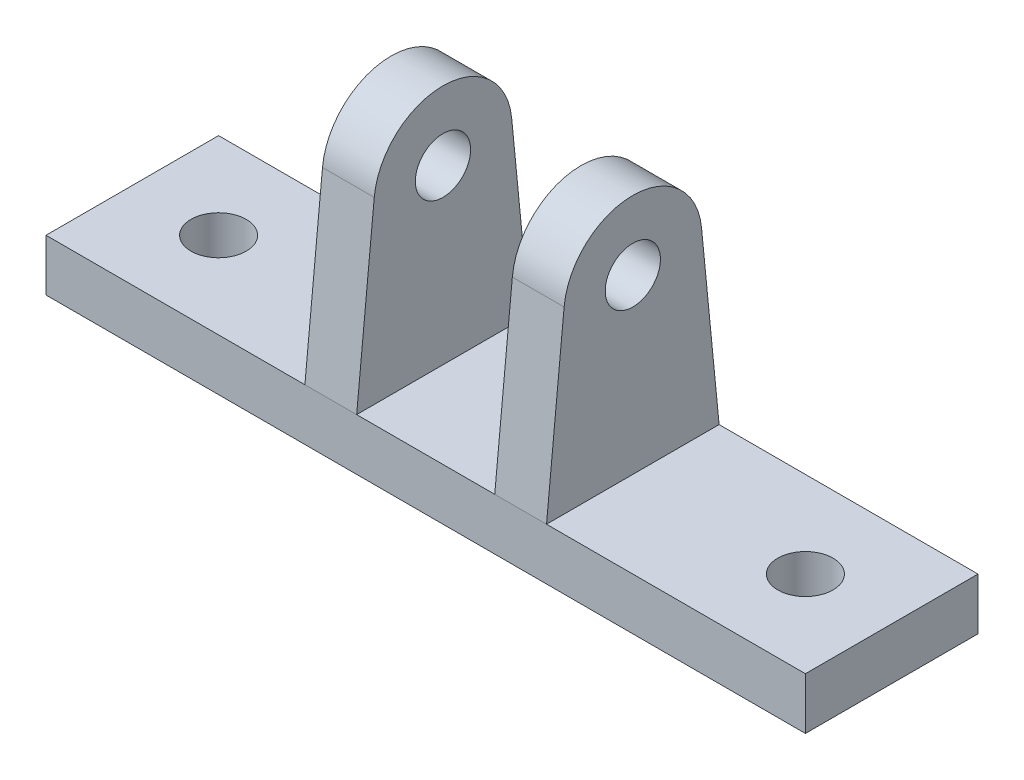
ISO-10303-21;
HEADER;
FILE_DESCRIPTION(('STEP AP214'),'2;1');
FILE_NAME('part.step','',(''),(''),'','','');
FILE_SCHEMA(('AUTOMOTIVE_DESIGN { 1 0 10303 214 1 1 1 1 }'));
ENDSEC;
DATA;
#1=APPLICATION_CONTEXT('core data for automotive mechanical design processes');
#2=APPLICATION_PROTOCOL_DEFINITION('international standard','automotive_design',2000,#1);
#3=PRODUCT_CONTEXT('',#1,'mechanical');
#4=PRODUCT('Part','Part','',(#3));
#5=PRODUCT_RELATED_PRODUCT_CATEGORY('part','',(#4));
#6=PRODUCT_DEFINITION_FORMATION('','',#4);
#7=PRODUCT_DEFINITION_CONTEXT('part definition',#1,'design');
#8=PRODUCT_DEFINITION('design','',#6,#7);
#9=PRODUCT_DEFINITION_SHAPE('','',#8);
#10=(LENGTH_UNIT() NAMED_UNIT(*) SI_UNIT(.MILLI.,.METRE.));
#11=(NAMED_UNIT(*) PLANE_ANGLE_UNIT() SI_UNIT($,.RADIAN.));
#12=(NAMED_UNIT(*) SI_UNIT($,.STERADIAN.) SOLID_ANGLE_UNIT());
#13=UNCERTAINTY_MEASURE_WITH_UNIT(LENGTH_MEASURE(1.E-05),#10,'distance_accuracy_value','');
#14=(GEOMETRIC_REPRESENTATION_CONTEXT(3) GLOBAL_UNCERTAINTY_ASSIGNED_CONTEXT((#13)) GLOBAL_UNIT_ASSIGNED_CONTEXT((#10,
#11,#12)) REPRESENTATION_CONTEXT('',''));
#15=CARTESIAN_POINT('',(0.,0.,0.));
#16=DIRECTION('',(0.,0.,1.));
#17=DIRECTION('',(1.,0.,0.));
#18=AXIS2_PLACEMENT_3D('',#15,#16,#17);
#19=CARTESIAN_POINT('',(0.,3.,0.));
#20=DIRECTION('',(0.,1.,0.));
#21=DIRECTION('',(0.,0.,1.));
#22=AXIS2_PLACEMENT_3D('',#19,#20,#21);
#23=PLANE('',#22);
#24=DIRECTION('',(1.,0.,0.));
#25=VECTOR('',#24,1.);
#26=CARTESIAN_POINT('',(0.,3.,-5.));
#27=LINE('',#26,#25);
#28=CARTESIAN_POINT('',(-4.,3.,-5.));
#29=VERTEX_POINT('',#28);
#30=CARTESIAN_POINT('',(4.,3.,-5.));
#31=VERTEX_POINT('',#30);
#32=EDGE_CURVE('E178',#29,#31,#27,.T.);
#33=ORIENTED_EDGE('',*,*,#32,.F.);
#34=DIRECTION('',(0.,0.,1.));
#35=VECTOR('',#34,1.);
#36=CARTESIAN_POINT('',(-4.,3.,0.));
#37=LINE('',#36,#35);
#38=CARTESIAN_POINT('',(-4.,3.,5.));
#39=VERTEX_POINT('',#38);
#40=EDGE_CURVE('E284',#29,#39,#37,.T.);
#41=ORIENTED_EDGE('',*,*,#40,.T.);
#42=DIRECTION('',(-1.,0.,0.));
#43=VECTOR('',#42,1.);
#44=CARTESIAN_POINT('',(0.,3.,5.));
#45=LINE('',#44,#43);
#46=CARTESIAN_POINT('',(4.,3.,5.));
#47=VERTEX_POINT('',#46);
#48=EDGE_CURVE('E204',#47,#39,#45,.T.);
#49=ORIENTED_EDGE('',*,*,#48,.F.);
#50=DIRECTION('',(0.,0.,1.));
#51=VECTOR('',#50,1.);
#52=CARTESIAN_POINT('',(4.,3.,0.));
#53=LINE('',#52,#51);
#54=EDGE_CURVE('E239',#31,#47,#53,.T.);
#55=ORIENTED_EDGE('',*,*,#54,.F.);
#56=EDGE_LOOP('',(#33,#41,#49,#55));
#57=FACE_BOUND('',#56,.T.);
#58=ADVANCED_FACE('F44',(#57),#23,.T.);
#59=CARTESIAN_POINT('',(17.,3.,0.));
#60=DIRECTION('',(0.,1.,0.));
#61=DIRECTION('',(0.,0.,1.));
#62=AXIS2_PLACEMENT_3D('',#59,#60,#61);
#63=CIRCLE('',#62,1.6);
#64=CARTESIAN_POINT('',(17.,3.,1.6));
#65=VERTEX_POINT('',#64);
#66=EDGE_CURVE('E213',#65,#65,#63,.T.);
#67=ORIENTED_EDGE('',*,*,#66,.F.);
#68=EDGE_LOOP('',(#67));
#69=FACE_BOUND('',#68,.T.);
#70=CARTESIAN_POINT('',(7.,3.,-5.));
#71=VERTEX_POINT('',#70);
#72=CARTESIAN_POINT('',(22.,3.,-5.));
#73=VERTEX_POINT('',#72);
#74=EDGE_CURVE('E180',#71,#73,#27,.T.);
#75=ORIENTED_EDGE('',*,*,#74,.F.);
#76=DIRECTION('',(0.,0.,1.));
#77=VECTOR('',#76,1.);
#78=CARTESIAN_POINT('',(7.,3.,0.));
#79=LINE('',#78,#77);
#80=CARTESIAN_POINT('',(7.,3.,5.));
#81=VERTEX_POINT('',#80);
#82=EDGE_CURVE('E255',#71,#81,#79,.T.);
#83=ORIENTED_EDGE('',*,*,#82,.T.);
#84=CARTESIAN_POINT('',(22.,3.,5.));
#85=VERTEX_POINT('',#84);
#86=EDGE_CURVE('E198',#85,#81,#45,.T.);
#87=ORIENTED_EDGE('',*,*,#86,.F.);
#88=DIRECTION('',(0.,0.,1.));
#89=VECTOR('',#88,1.);
#90=CARTESIAN_POINT('',(22.,3.,0.));
#91=LINE('',#90,#89);
#92=EDGE_CURVE('E190',#73,#85,#91,.T.);
#93=ORIENTED_EDGE('',*,*,#92,.F.);
#94=EDGE_LOOP('',(#75,#83,#87,#93));
#95=FACE_BOUND('',#94,.T.);
#96=ADVANCED_FACE('F344',(#69,#95),#23,.T.);
#97=CARTESIAN_POINT('',(-22.,3.,0.));
#98=DIRECTION('',(-1.,0.,0.));
#99=DIRECTION('',(0.,0.,1.));
#100=AXIS2_PLACEMENT_3D('',#97,#98,#99);
#101=PLANE('',#100);
#102=DIRECTION('',(0.,0.,-1.));
#103=VECTOR('',#102,1.);
#104=CARTESIAN_POINT('',(-22.,0.,0.));
#105=LINE('',#104,#103);
#106=CARTESIAN_POINT('',(-22.,0.,5.));
#107=VERTEX_POINT('',#106);
#108=CARTESIAN_POINT('',(-22.,0.,-5.));
#109=VERTEX_POINT('',#108);
#110=EDGE_CURVE('E319',#107,#109,#105,.T.);
#111=ORIENTED_EDGE('',*,*,#110,.F.);
#112=DIRECTION('',(0.,-1.,0.));
#113=VECTOR('',#112,1.);
#114=CARTESIAN_POINT('',(-22.,3.,5.));
#115=LINE('',#114,#113);
#116=CARTESIAN_POINT('',(-22.,3.,5.));
#117=VERTEX_POINT('',#116);
#118=EDGE_CURVE('E11',#117,#107,#115,.T.);
#119=ORIENTED_EDGE('',*,*,#118,.F.);
#120=DIRECTION('',(0.,0.,-1.));
#121=VECTOR('',#120,1.);
#122=CARTESIAN_POINT('',(-22.,3.,0.));
#123=LINE('',#122,#121);
#124=CARTESIAN_POINT('',(-22.,3.,-5.));
#125=VERTEX_POINT('',#124);
#126=EDGE_CURVE('E207',#117,#125,#123,.T.);
#127=ORIENTED_EDGE('',*,*,#126,.T.);
#128=DIRECTION('',(0.,-1.,0.));
#129=VECTOR('',#128,1.);
#130=CARTESIAN_POINT('',(-22.,3.,-5.));
#131=LINE('',#130,#129);
#132=EDGE_CURVE('E175',#125,#109,#131,.T.);
#133=ORIENTED_EDGE('',*,*,#132,.T.);
#134=EDGE_LOOP('',(#111,#119,#127,#133));
#135=FACE_BOUND('',#134,.T.);
#136=ADVANCED_FACE('F317',(#135),#101,.T.);
#137=CARTESIAN_POINT('',(0.,3.,5.));
#138=DIRECTION('',(0.,0.,1.));
#139=DIRECTION('',(1.,0.,0.));
#140=AXIS2_PLACEMENT_3D('',#137,#138,#139);
#141=PLANE('',#140);
#142=DIRECTION('',(-1.,0.,0.));
#143=VECTOR('',#142,1.);
#144=CARTESIAN_POINT('',(0.,0.,5.));
#145=LINE('',#144,#143);
#146=CARTESIAN_POINT('',(22.,0.,5.));
#147=VERTEX_POINT('',#146);
#148=EDGE_CURVE('E324',#147,#107,#145,.T.);
#149=ORIENTED_EDGE('',*,*,#148,.F.);
#150=DIRECTION('',(0.,-1.,0.));
#151=VECTOR('',#150,1.);
#152=CARTESIAN_POINT('',(22.,3.,5.));
#153=LINE('',#152,#151);
#154=EDGE_CURVE('E53',#85,#147,#153,.T.);
#155=ORIENTED_EDGE('',*,*,#154,.F.);
#156=ORIENTED_EDGE('',*,*,#86,.T.);
#157=DIRECTION('',(-1.,0.,0.));
#158=VECTOR('',#157,1.);
#159=CARTESIAN_POINT('',(7.,3.,5.));
#160=LINE('',#159,#158);
#161=EDGE_CURVE('E226',#81,#47,#160,.T.);
#162=ORIENTED_EDGE('',*,*,#161,.T.);
#163=ORIENTED_EDGE('',*,*,#48,.T.);
#164=DIRECTION('',(1.,0.,0.));
#165=VECTOR('',#164,1.);
#166=CARTESIAN_POINT('',(-7.,3.,5.));
#167=LINE('',#166,#165);
#168=CARTESIAN_POINT('',(-7.,3.,5.));
#169=VERTEX_POINT('',#168);
#170=EDGE_CURVE('E148',#169,#39,#167,.T.);
#171=ORIENTED_EDGE('',*,*,#170,.F.);
#172=EDGE_CURVE('E168',#169,#117,#45,.T.);
#173=ORIENTED_EDGE('',*,*,#172,.T.);
#174=ORIENTED_EDGE('',*,*,#118,.T.);
#175=EDGE_LOOP('',(#149,#155,#156,#162,#163,#171,#173,#174));
#176=FACE_BOUND('',#175,.T.);
#177=ADVANCED_FACE('F311',(#176),#141,.T.);
#178=CARTESIAN_POINT('',(22.,3.,0.));
#179=DIRECTION('',(1.,0.,0.));
#180=DIRECTION('',(0.,0.,-1.));
#181=AXIS2_PLACEMENT_3D('',#178,#179,#180);
#182=PLANE('',#181);
#183=DIRECTION('',(0.,0.,1.));
#184=VECTOR('',#183,1.);
#185=CARTESIAN_POINT('',(22.,0.,0.));
#186=LINE('',#185,#184);
#187=CARTESIAN_POINT('',(22.,0.,-5.));
#188=VERTEX_POINT('',#187);
#189=EDGE_CURVE('E330',#188,#147,#186,.T.);
#190=ORIENTED_EDGE('',*,*,#189,.F.);
#191=DIRECTION('',(0.,-1.,0.));
#192=VECTOR('',#191,1.);
#193=CARTESIAN_POINT('',(22.,3.,-5.));
#194=LINE('',#193,#192);
#195=EDGE_CURVE('E184',#73,#188,#194,.T.);
#196=ORIENTED_EDGE('',*,*,#195,.F.);
#197=ORIENTED_EDGE('',*,*,#92,.T.);
#198=ORIENTED_EDGE('',*,*,#154,.T.);
#199=EDGE_LOOP('',(#190,#196,#197,#198));
#200=FACE_BOUND('',#199,.T.);
#201=ADVANCED_FACE('F341',(#200),#182,.T.);
#202=CARTESIAN_POINT('',(-17.,3.,0.));
#203=DIRECTION('',(0.,-1.,0.));
#204=DIRECTION('',(0.,0.,-1.));
#205=AXIS2_PLACEMENT_3D('',#202,#203,#204);
#206=CYLINDRICAL_SURFACE('',#205,1.6);
#207=CARTESIAN_POINT('',(-17.,3.,0.));
#208=DIRECTION('',(0.,1.,0.));
#209=DIRECTION('',(0.,0.,1.));
#210=AXIS2_PLACEMENT_3D('',#207,#208,#209);
#211=CIRCLE('',#210,1.6);
#212=CARTESIAN_POINT('',(-17.,3.,1.6));
#213=VERTEX_POINT('',#212);
#214=EDGE_CURVE('E209',#213,#213,#211,.T.);
#215=ORIENTED_EDGE('',*,*,#214,.T.);
#216=EDGE_LOOP('',(#215));
#217=FACE_BOUND('',#216,.T.);
#218=CARTESIAN_POINT('',(-17.,0.,0.));
#219=DIRECTION('',(0.,1.,0.));
#220=DIRECTION('',(0.,0.,1.));
#221=AXIS2_PLACEMENT_3D('',#218,#219,#220);
#222=CIRCLE('',#221,1.6);
#223=CARTESIAN_POINT('',(-17.,0.,1.6));
#224=VERTEX_POINT('',#223);
#225=EDGE_CURVE('E325',#224,#224,#222,.T.);
#226=ORIENTED_EDGE('',*,*,#225,.F.);
#227=EDGE_LOOP('',(#226));
#228=FACE_BOUND('',#227,.T.);
#229=ADVANCED_FACE('F391',(#217,#228),#206,.F.);
#230=CARTESIAN_POINT('',(17.,3.,0.));
#231=DIRECTION('',(0.,-1.,0.));
#232=DIRECTION('',(0.,0.,-1.));
#233=AXIS2_PLACEMENT_3D('',#230,#231,#232);
#234=CYLINDRICAL_SURFACE('',#233,1.6);
#235=ORIENTED_EDGE('',*,*,#66,.T.);
#236=EDGE_LOOP('',(#235));
#237=FACE_BOUND('',#236,.T.);
#238=CARTESIAN_POINT('',(17.,0.,0.));
#239=DIRECTION('',(0.,1.,0.));
#240=DIRECTION('',(0.,0.,1.));
#241=AXIS2_PLACEMENT_3D('',#238,#239,#240);
#242=CIRCLE('',#241,1.6);
#243=CARTESIAN_POINT('',(17.,0.,1.6));
#244=VERTEX_POINT('',#243);
#245=EDGE_CURVE('E222',#244,#244,#242,.T.);
#246=ORIENTED_EDGE('',*,*,#245,.F.);
#247=EDGE_LOOP('',(#246));
#248=FACE_BOUND('',#247,.T.);
#249=ADVANCED_FACE('F46',(#237,#248),#234,.F.);
#250=CARTESIAN_POINT('',(0.,3.,-5.));
#251=DIRECTION('',(0.,0.,-1.));
#252=DIRECTION('',(-1.,0.,0.));
#253=AXIS2_PLACEMENT_3D('',#250,#251,#252);
#254=PLANE('',#253);
#255=DIRECTION('',(1.,0.,0.));
#256=VECTOR('',#255,1.);
#257=CARTESIAN_POINT('',(0.,0.,-5.));
#258=LINE('',#257,#256);
#259=EDGE_CURVE('E217',#109,#188,#258,.T.);
#260=ORIENTED_EDGE('',*,*,#259,.F.);
#261=ORIENTED_EDGE('',*,*,#132,.F.);
#262=CARTESIAN_POINT('',(-7.,3.,-5.));
#263=VERTEX_POINT('',#262);
#264=EDGE_CURVE('E167',#125,#263,#27,.T.);
#265=ORIENTED_EDGE('',*,*,#264,.T.);
#266=DIRECTION('',(1.,0.,0.));
#267=VECTOR('',#266,1.);
#268=CARTESIAN_POINT('',(-7.,3.,-5.));
#269=LINE('',#268,#267);
#270=EDGE_CURVE('E136',#263,#29,#269,.T.);
#271=ORIENTED_EDGE('',*,*,#270,.T.);
#272=ORIENTED_EDGE('',*,*,#32,.T.);
#273=DIRECTION('',(-1.,0.,0.));
#274=VECTOR('',#273,1.);
#275=CARTESIAN_POINT('',(7.,3.,-5.));
#276=LINE('',#275,#274);
#277=EDGE_CURVE('E230',#71,#31,#276,.T.);
#278=ORIENTED_EDGE('',*,*,#277,.F.);
#279=ORIENTED_EDGE('',*,*,#74,.T.);
#280=ORIENTED_EDGE('',*,*,#195,.T.);
#281=EDGE_LOOP('',(#260,#261,#265,#271,#272,#278,#279,#280));
#282=FACE_BOUND('',#281,.T.);
#283=ADVANCED_FACE('F174',(#282),#254,.T.);
#284=DIRECTION('',(0.,0.,1.));
#285=VECTOR('',#284,1.);
#286=CARTESIAN_POINT('',(-7.,3.,0.));
#287=LINE('',#286,#285);
#288=EDGE_CURVE('E154',#263,#169,#287,.T.);
#289=ORIENTED_EDGE('',*,*,#288,.F.);
#290=ORIENTED_EDGE('',*,*,#264,.F.);
#291=ORIENTED_EDGE('',*,*,#126,.F.);
#292=ORIENTED_EDGE('',*,*,#172,.F.);
#293=EDGE_LOOP('',(#289,#290,#291,#292));
#294=FACE_BOUND('',#293,.T.);
#295=ORIENTED_EDGE('',*,*,#214,.F.);
#296=EDGE_LOOP('',(#295));
#297=FACE_BOUND('',#296,.T.);
#298=ADVANCED_FACE('F164',(#294,#297),#23,.T.);
#299=CARTESIAN_POINT('',(0.,0.,0.));
#300=DIRECTION('',(0.,1.,0.));
#301=DIRECTION('',(0.,0.,1.));
#302=AXIS2_PLACEMENT_3D('',#299,#300,#301);
#303=PLANE('',#302);
#304=ORIENTED_EDGE('',*,*,#245,.T.);
#305=EDGE_LOOP('',(#304));
#306=FACE_BOUND('',#305,.T.);
#307=ORIENTED_EDGE('',*,*,#225,.T.);
#308=EDGE_LOOP('',(#307));
#309=FACE_BOUND('',#308,.T.);
#310=ORIENTED_EDGE('',*,*,#110,.T.);
#311=ORIENTED_EDGE('',*,*,#259,.T.);
#312=ORIENTED_EDGE('',*,*,#189,.T.);
#313=ORIENTED_EDGE('',*,*,#148,.T.);
#314=EDGE_LOOP('',(#310,#311,#312,#313));
#315=FACE_BOUND('',#314,.T.);
#316=ADVANCED_FACE('F328',(#306,#309,#315),#303,.F.);
#317=CARTESIAN_POINT('',(7.,0.514315035260257,-5.2437975782273));
#318=DIRECTION('',(0.,-0.097612260356422,0.995224520712844));
#319=DIRECTION('',(0.,-0.995224520712844,-0.097612260356422));
#320=AXIS2_PLACEMENT_3D('',#317,#318,#319);
#321=PLANE('',#320);
#322=DIRECTION('',(0.,0.995224520712844,0.097612260356422));
#323=VECTOR('',#322,1.);
#324=CARTESIAN_POINT('',(4.,0.514315035260257,-5.2437975782273));
#325=LINE('',#324,#323);
#326=CARTESIAN_POINT('',(4.,13.3904490414257,-3.98089808285138));
#327=VERTEX_POINT('',#326);
#328=EDGE_CURVE('E147',#31,#327,#325,.T.);
#329=ORIENTED_EDGE('',*,*,#328,.T.);
#330=DIRECTION('',(-1.,0.,0.));
#331=VECTOR('',#330,1.);
#332=CARTESIAN_POINT('',(7.,13.3904490414257,-3.98089808285138));
#333=LINE('',#332,#331);
#334=CARTESIAN_POINT('',(7.,13.3904490414257,-3.98089808285138));
#335=VERTEX_POINT('',#334);
#336=EDGE_CURVE('E218',#335,#327,#333,.T.);
#337=ORIENTED_EDGE('',*,*,#336,.F.);
#338=DIRECTION('',(0.,0.995224520712844,0.097612260356422));
#339=VECTOR('',#338,1.);
#340=CARTESIAN_POINT('',(7.,0.514315035260257,-5.2437975782273));
#341=LINE('',#340,#339);
#342=EDGE_CURVE('E238',#71,#335,#341,.T.);
#343=ORIENTED_EDGE('',*,*,#342,.F.);
#344=ORIENTED_EDGE('',*,*,#277,.T.);
#345=EDGE_LOOP('',(#329,#337,#343,#344));
#346=FACE_BOUND('',#345,.T.);
#347=ADVANCED_FACE('F350',(#346),#321,.F.);
#348=CARTESIAN_POINT('',(7.,13.,0.));
#349=DIRECTION('',(-1.,0.,0.));
#350=DIRECTION('',(0.,0.,1.));
#351=AXIS2_PLACEMENT_3D('',#348,#349,#350);
#352=CYLINDRICAL_SURFACE('',#351,4.);
#353=CARTESIAN_POINT('',(4.,13.,0.));
#354=DIRECTION('',(1.,0.,0.));
#355=DIRECTION('',(0.,0.,-1.));
#356=AXIS2_PLACEMENT_3D('',#353,#354,#355);
#357=CIRCLE('',#356,4.);
#358=CARTESIAN_POINT('',(4.,13.3904490414257,3.98089808285138));
#359=VERTEX_POINT('',#358);
#360=EDGE_CURVE('E247',#327,#359,#357,.T.);
#361=ORIENTED_EDGE('',*,*,#360,.T.);
#362=DIRECTION('',(-1.,0.,0.));
#363=VECTOR('',#362,1.);
#364=CARTESIAN_POINT('',(7.,13.3904490414257,3.98089808285138));
#365=LINE('',#364,#363);
#366=CARTESIAN_POINT('',(7.,13.3904490414257,3.98089808285138));
#367=VERTEX_POINT('',#366);
#368=EDGE_CURVE('E223',#367,#359,#365,.T.);
#369=ORIENTED_EDGE('',*,*,#368,.F.);
#370=CARTESIAN_POINT('',(7.,13.,0.));
#371=DIRECTION('',(1.,0.,0.));
#372=DIRECTION('',(0.,0.,-1.));
#373=AXIS2_PLACEMENT_3D('',#370,#371,#372);
#374=CIRCLE('',#373,4.);
#375=EDGE_CURVE('E261',#335,#367,#374,.T.);
#376=ORIENTED_EDGE('',*,*,#375,.F.);
#377=ORIENTED_EDGE('',*,*,#336,.T.);
#378=EDGE_LOOP('',(#361,#369,#376,#377));
#379=FACE_BOUND('',#378,.T.);
#380=ADVANCED_FACE('F353',(#379),#352,.T.);
#381=CARTESIAN_POINT('',(7.,0.514315035260257,5.2437975782273));
#382=DIRECTION('',(0.,0.097612260356422,0.995224520712844));
#383=DIRECTION('',(0.,-0.995224520712844,0.097612260356422));
#384=AXIS2_PLACEMENT_3D('',#381,#382,#383);
#385=PLANE('',#384);
#386=DIRECTION('',(0.,0.995224520712844,-0.097612260356422));
#387=VECTOR('',#386,1.);
#388=CARTESIAN_POINT('',(4.,0.514315035260257,5.2437975782273));
#389=LINE('',#388,#387);
#390=EDGE_CURVE('E243',#47,#359,#389,.T.);
#391=ORIENTED_EDGE('',*,*,#390,.F.);
#392=ORIENTED_EDGE('',*,*,#161,.F.);
#393=DIRECTION('',(0.,0.995224520712844,-0.097612260356422));
#394=VECTOR('',#393,1.);
#395=CARTESIAN_POINT('',(7.,0.514315035260257,5.2437975782273));
#396=LINE('',#395,#394);
#397=EDGE_CURVE('E68',#81,#367,#396,.T.);
#398=ORIENTED_EDGE('',*,*,#397,.T.);
#399=ORIENTED_EDGE('',*,*,#368,.T.);
#400=EDGE_LOOP('',(#391,#392,#398,#399));
#401=FACE_BOUND('',#400,.T.);
#402=ADVANCED_FACE('F355',(#401),#385,.T.);
#403=CARTESIAN_POINT('',(7.,13.,0.));
#404=DIRECTION('',(-1.,0.,0.));
#405=DIRECTION('',(0.,0.,1.));
#406=AXIS2_PLACEMENT_3D('',#403,#404,#405);
#407=CYLINDRICAL_SURFACE('',#406,1.6);
#408=CARTESIAN_POINT('',(7.,13.,0.));
#409=DIRECTION('',(1.,0.,0.));
#410=DIRECTION('',(0.,0.,-1.));
#411=AXIS2_PLACEMENT_3D('',#408,#409,#410);
#412=CIRCLE('',#411,1.6);
#413=CARTESIAN_POINT('',(7.,13.,-1.6));
#414=VERTEX_POINT('',#413);
#415=EDGE_CURVE('E233',#414,#414,#412,.T.);
#416=ORIENTED_EDGE('',*,*,#415,.T.);
#417=EDGE_LOOP('',(#416));
#418=FACE_BOUND('',#417,.T.);
#419=CARTESIAN_POINT('',(4.,13.,0.));
#420=DIRECTION('',(1.,0.,0.));
#421=DIRECTION('',(0.,0.,-1.));
#422=AXIS2_PLACEMENT_3D('',#419,#420,#421);
#423=CIRCLE('',#422,1.6);
#424=CARTESIAN_POINT('',(4.,13.,-1.6));
#425=VERTEX_POINT('',#424);
#426=EDGE_CURVE('E234',#425,#425,#423,.T.);
#427=ORIENTED_EDGE('',*,*,#426,.F.);
#428=EDGE_LOOP('',(#427));
#429=FACE_BOUND('',#428,.T.);
#430=ADVANCED_FACE('F363',(#418,#429),#407,.F.);
#431=CARTESIAN_POINT('',(7.,0.,0.));
#432=DIRECTION('',(1.,0.,0.));
#433=DIRECTION('',(0.,0.,-1.));
#434=AXIS2_PLACEMENT_3D('',#431,#432,#433);
#435=PLANE('',#434);
#436=ORIENTED_EDGE('',*,*,#342,.T.);
#437=ORIENTED_EDGE('',*,*,#375,.T.);
#438=ORIENTED_EDGE('',*,*,#397,.F.);
#439=ORIENTED_EDGE('',*,*,#82,.F.);
#440=EDGE_LOOP('',(#436,#437,#438,#439));
#441=FACE_BOUND('',#440,.T.);
#442=ORIENTED_EDGE('',*,*,#415,.F.);
#443=EDGE_LOOP('',(#442));
#444=FACE_BOUND('',#443,.T.);
#445=ADVANCED_FACE('F345',(#441,#444),#435,.T.);
#446=CARTESIAN_POINT('',(4.,0.,0.));
#447=DIRECTION('',(1.,0.,0.));
#448=DIRECTION('',(0.,0.,-1.));
#449=AXIS2_PLACEMENT_3D('',#446,#447,#448);
#450=PLANE('',#449);
#451=ORIENTED_EDGE('',*,*,#328,.F.);
#452=ORIENTED_EDGE('',*,*,#54,.T.);
#453=ORIENTED_EDGE('',*,*,#390,.T.);
#454=ORIENTED_EDGE('',*,*,#360,.F.);
#455=EDGE_LOOP('',(#451,#452,#453,#454));
#456=FACE_BOUND('',#455,.T.);
#457=ORIENTED_EDGE('',*,*,#426,.T.);
#458=EDGE_LOOP('',(#457));
#459=FACE_BOUND('',#458,.T.);
#460=ADVANCED_FACE('F357',(#456,#459),#450,.F.);
#461=CARTESIAN_POINT('',(-7.,0.514315035260257,-5.2437975782273));
#462=DIRECTION('',(0.,0.097612260356422,-0.995224520712844));
#463=DIRECTION('',(0.,0.995224520712844,0.097612260356422));
#464=AXIS2_PLACEMENT_3D('',#461,#462,#463);
#465=PLANE('',#464);
#466=DIRECTION('',(0.,0.995224520712844,0.097612260356422));
#467=VECTOR('',#466,1.);
#468=CARTESIAN_POINT('',(-4.,0.514315035260257,-5.2437975782273));
#469=LINE('',#468,#467);
#470=CARTESIAN_POINT('',(-4.,13.3904490414257,-3.98089808285138));
#471=VERTEX_POINT('',#470);
#472=EDGE_CURVE('E142',#29,#471,#469,.T.);
#473=ORIENTED_EDGE('',*,*,#472,.F.);
#474=ORIENTED_EDGE('',*,*,#270,.F.);
#475=DIRECTION('',(0.,0.995224520712844,0.097612260356422));
#476=VECTOR('',#475,1.);
#477=CARTESIAN_POINT('',(-7.,0.514315035260257,-5.2437975782273));
#478=LINE('',#477,#476);
#479=CARTESIAN_POINT('',(-7.,13.3904490414257,-3.98089808285138));
#480=VERTEX_POINT('',#479);
#481=EDGE_CURVE('E139',#263,#480,#478,.T.);
#482=ORIENTED_EDGE('',*,*,#481,.T.);
#483=DIRECTION('',(1.,0.,0.));
#484=VECTOR('',#483,1.);
#485=CARTESIAN_POINT('',(-7.,13.3904490414257,-3.98089808285138));
#486=LINE('',#485,#484);
#487=EDGE_CURVE('E272',#480,#471,#486,.T.);
#488=ORIENTED_EDGE('',*,*,#487,.T.);
#489=EDGE_LOOP('',(#473,#474,#482,#488));
#490=FACE_BOUND('',#489,.T.);
#491=ADVANCED_FACE('F138',(#490),#465,.T.);
#492=CARTESIAN_POINT('',(-7.,0.514315035260257,5.2437975782273));
#493=DIRECTION('',(0.,-0.097612260356422,-0.995224520712844));
#494=DIRECTION('',(0.,0.995224520712844,-0.097612260356422));
#495=AXIS2_PLACEMENT_3D('',#492,#493,#494);
#496=PLANE('',#495);
#497=DIRECTION('',(0.,0.995224520712844,-0.097612260356422));
#498=VECTOR('',#497,1.);
#499=CARTESIAN_POINT('',(-4.,0.514315035260257,5.2437975782273));
#500=LINE('',#499,#498);
#501=CARTESIAN_POINT('',(-4.,13.3904490414257,3.98089808285138));
#502=VERTEX_POINT('',#501);
#503=EDGE_CURVE('E60',#39,#502,#500,.T.);
#504=ORIENTED_EDGE('',*,*,#503,.T.);
#505=DIRECTION('',(1.,0.,0.));
#506=VECTOR('',#505,1.);
#507=CARTESIAN_POINT('',(-7.,13.3904490414257,3.98089808285138));
#508=LINE('',#507,#506);
#509=CARTESIAN_POINT('',(-7.,13.3904490414257,3.98089808285138));
#510=VERTEX_POINT('',#509);
#511=EDGE_CURVE('E269',#510,#502,#508,.T.);
#512=ORIENTED_EDGE('',*,*,#511,.F.);
#513=DIRECTION('',(0.,0.995224520712844,-0.097612260356422));
#514=VECTOR('',#513,1.);
#515=CARTESIAN_POINT('',(-7.,0.514315035260257,5.2437975782273));
#516=LINE('',#515,#514);
#517=EDGE_CURVE('E171',#169,#510,#516,.T.);
#518=ORIENTED_EDGE('',*,*,#517,.F.);
#519=ORIENTED_EDGE('',*,*,#170,.T.);
#520=EDGE_LOOP('',(#504,#512,#518,#519));
#521=FACE_BOUND('',#520,.T.);
#522=ADVANCED_FACE('F299',(#521),#496,.F.);
#523=CARTESIAN_POINT('',(-7.,13.,0.));
#524=DIRECTION('',(1.,0.,0.));
#525=DIRECTION('',(0.,0.,-1.));
#526=AXIS2_PLACEMENT_3D('',#523,#524,#525);
#527=CYLINDRICAL_SURFACE('',#526,4.);
#528=CARTESIAN_POINT('',(-4.,13.,0.));
#529=DIRECTION('',(1.,0.,0.));
#530=DIRECTION('',(0.,0.,-1.));
#531=AXIS2_PLACEMENT_3D('',#528,#529,#530);
#532=CIRCLE('',#531,4.);
#533=EDGE_CURVE('E279',#471,#502,#532,.T.);
#534=ORIENTED_EDGE('',*,*,#533,.F.);
#535=ORIENTED_EDGE('',*,*,#487,.F.);
#536=CARTESIAN_POINT('',(-7.,13.,0.));
#537=DIRECTION('',(1.,0.,0.));
#538=DIRECTION('',(0.,0.,-1.));
#539=AXIS2_PLACEMENT_3D('',#536,#537,#538);
#540=CIRCLE('',#539,4.);
#541=EDGE_CURVE('E157',#480,#510,#540,.T.);
#542=ORIENTED_EDGE('',*,*,#541,.T.);
#543=ORIENTED_EDGE('',*,*,#511,.T.);
#544=EDGE_LOOP('',(#534,#535,#542,#543));
#545=FACE_BOUND('',#544,.T.);
#546=ADVANCED_FACE('F302',(#545),#527,.T.);
#547=CARTESIAN_POINT('',(-7.,13.,0.));
#548=DIRECTION('',(1.,0.,0.));
#549=DIRECTION('',(0.,0.,-1.));
#550=AXIS2_PLACEMENT_3D('',#547,#548,#549);
#551=CYLINDRICAL_SURFACE('',#550,1.6);
#552=CARTESIAN_POINT('',(-7.,13.,0.));
#553=DIRECTION('',(1.,0.,0.));
#554=DIRECTION('',(0.,0.,-1.));
#555=AXIS2_PLACEMENT_3D('',#552,#553,#554);
#556=CIRCLE('',#555,1.6);
#557=CARTESIAN_POINT('',(-7.,13.,-1.6));
#558=VERTEX_POINT('',#557);
#559=EDGE_CURVE('E275',#558,#558,#556,.T.);
#560=ORIENTED_EDGE('',*,*,#559,.F.);
#561=EDGE_LOOP('',(#560));
#562=FACE_BOUND('',#561,.T.);
#563=CARTESIAN_POINT('',(-4.,13.,0.));
#564=DIRECTION('',(1.,0.,0.));
#565=DIRECTION('',(0.,0.,-1.));
#566=AXIS2_PLACEMENT_3D('',#563,#564,#565);
#567=CIRCLE('',#566,1.6);
#568=CARTESIAN_POINT('',(-4.,13.,-1.6));
#569=VERTEX_POINT('',#568);
#570=EDGE_CURVE('E159',#569,#569,#567,.T.);
#571=ORIENTED_EDGE('',*,*,#570,.T.);
#572=EDGE_LOOP('',(#571));
#573=FACE_BOUND('',#572,.T.);
#574=ADVANCED_FACE('F482',(#562,#573),#551,.F.);
#575=CARTESIAN_POINT('',(-7.,0.,0.));
#576=DIRECTION('',(-1.,0.,0.));
#577=DIRECTION('',(0.,0.,-1.));
#578=AXIS2_PLACEMENT_3D('',#575,#576,#577);
#579=PLANE('',#578);
#580=ORIENTED_EDGE('',*,*,#481,.F.);
#581=ORIENTED_EDGE('',*,*,#288,.T.);
#582=ORIENTED_EDGE('',*,*,#517,.T.);
#583=ORIENTED_EDGE('',*,*,#541,.F.);
#584=EDGE_LOOP('',(#580,#581,#582,#583));
#585=FACE_BOUND('',#584,.T.);
#586=ORIENTED_EDGE('',*,*,#559,.T.);
#587=EDGE_LOOP('',(#586));
#588=FACE_BOUND('',#587,.T.);
#589=ADVANCED_FACE('F152',(#585,#588),#579,.T.);
#590=CARTESIAN_POINT('',(-4.,0.,0.));
#591=DIRECTION('',(-1.,0.,0.));
#592=DIRECTION('',(0.,0.,-1.));
#593=AXIS2_PLACEMENT_3D('',#590,#591,#592);
#594=PLANE('',#593);
#595=ORIENTED_EDGE('',*,*,#472,.T.);
#596=ORIENTED_EDGE('',*,*,#533,.T.);
#597=ORIENTED_EDGE('',*,*,#503,.F.);
#598=ORIENTED_EDGE('',*,*,#40,.F.);
#599=EDGE_LOOP('',(#595,#596,#597,#598));
#600=FACE_BOUND('',#599,.T.);
#601=ORIENTED_EDGE('',*,*,#570,.F.);
#602=EDGE_LOOP('',(#601));
#603=FACE_BOUND('',#602,.T.);
#604=ADVANCED_FACE('F303',(#600,#603),#594,.F.);
#605=CLOSED_SHELL('',(#58,#96,#136,#177,#201,#229,#249,#283,#298,#316,#347,#380,#402,#430,#445,
#460,#491,#522,#546,#574,#589,#604));
#606=MANIFOLD_SOLID_BREP('B2',#605);
#607=ADVANCED_BREP_SHAPE_REPRESENTATION('',(#18,#606),#14);
#608=SHAPE_DEFINITION_REPRESENTATION(#9,#607);
ENDSEC;
END-ISO-10303-21;
